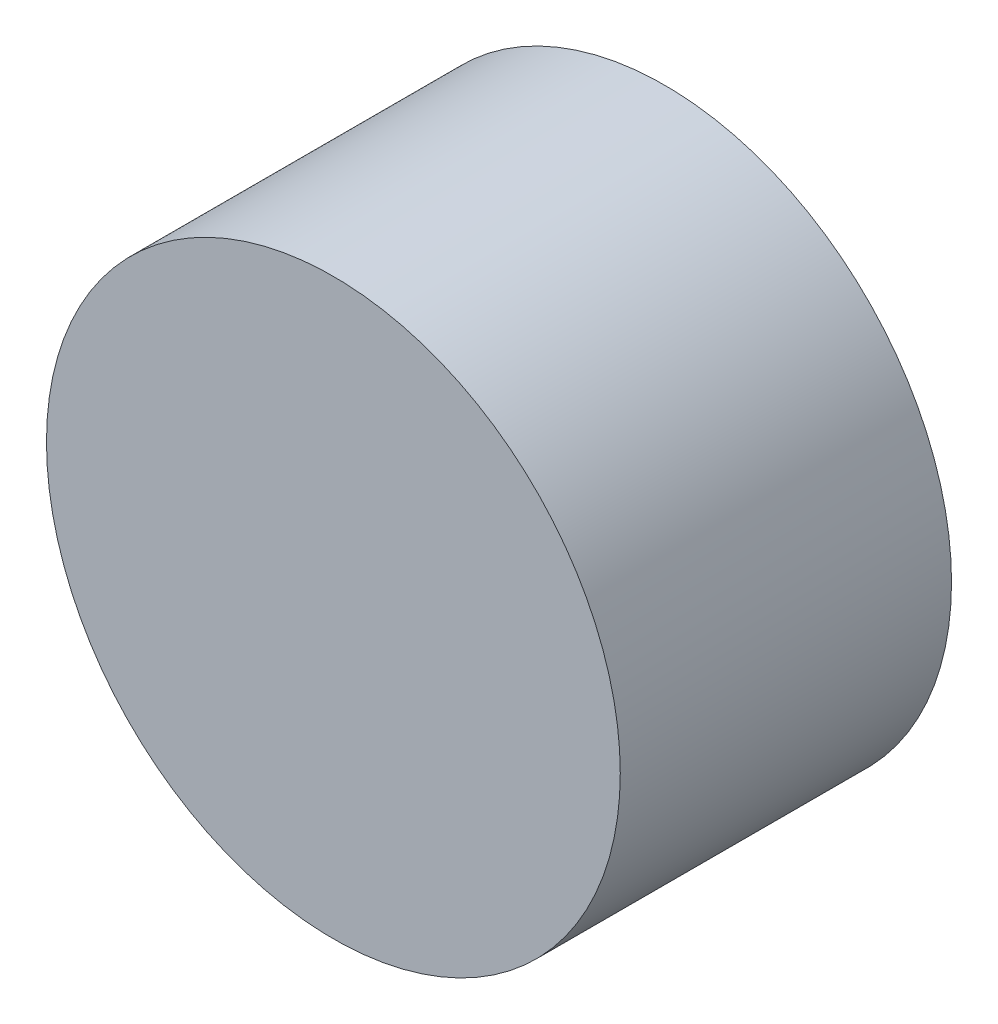
ISO-10303-21;
HEADER;
FILE_DESCRIPTION(('STEP AP214'),'2;1');
FILE_NAME('part.step','',(''),(''),'','','');
FILE_SCHEMA(('AUTOMOTIVE_DESIGN { 1 0 10303 214 1 1 1 1 }'));
ENDSEC;
DATA;
#1=APPLICATION_CONTEXT('core data for automotive mechanical design processes');
#2=APPLICATION_PROTOCOL_DEFINITION('international standard','automotive_design',2000,#1);
#3=PRODUCT_CONTEXT('',#1,'mechanical');
#4=PRODUCT('Part','Part','',(#3));
#5=PRODUCT_RELATED_PRODUCT_CATEGORY('part','',(#4));
#6=PRODUCT_DEFINITION_FORMATION('','',#4);
#7=PRODUCT_DEFINITION_CONTEXT('part definition',#1,'design');
#8=PRODUCT_DEFINITION('design','',#6,#7);
#9=PRODUCT_DEFINITION_SHAPE('','',#8);
#10=(LENGTH_UNIT() NAMED_UNIT(*) SI_UNIT(.MILLI.,.METRE.));
#11=(NAMED_UNIT(*) PLANE_ANGLE_UNIT() SI_UNIT($,.RADIAN.));
#12=(NAMED_UNIT(*) SI_UNIT($,.STERADIAN.) SOLID_ANGLE_UNIT());
#13=UNCERTAINTY_MEASURE_WITH_UNIT(LENGTH_MEASURE(1.E-05),#10,'distance_accuracy_value','');
#14=(GEOMETRIC_REPRESENTATION_CONTEXT(3) GLOBAL_UNCERTAINTY_ASSIGNED_CONTEXT((#13)) GLOBAL_UNIT_ASSIGNED_CONTEXT((#10,
#11,#12)) REPRESENTATION_CONTEXT('',''));
#15=CARTESIAN_POINT('',(0.,0.,0.));
#16=DIRECTION('',(0.,0.,1.));
#17=DIRECTION('',(1.,0.,0.));
#18=AXIS2_PLACEMENT_3D('',#15,#16,#17);
#19=CARTESIAN_POINT('',(0.,0.,6.35));
#20=DIRECTION('',(0.,0.,-1.));
#21=DIRECTION('',(-1.,0.,0.));
#22=AXIS2_PLACEMENT_3D('',#19,#20,#21);
#23=CYLINDRICAL_SURFACE('',#22,5.5);
#24=CARTESIAN_POINT('',(0.,0.,0.));
#25=DIRECTION('',(0.,0.,1.));
#26=DIRECTION('',(1.,0.,0.));
#27=AXIS2_PLACEMENT_3D('',#24,#25,#26);
#28=CIRCLE('',#27,5.5);
#29=CARTESIAN_POINT('',(5.5,0.,0.));
#30=VERTEX_POINT('',#29);
#31=EDGE_CURVE('E34',#30,#30,#28,.T.);
#32=ORIENTED_EDGE('',*,*,#31,.T.);
#33=EDGE_LOOP('',(#32));
#34=FACE_BOUND('',#33,.T.);
#35=CARTESIAN_POINT('',(0.,0.,6.35));
#36=DIRECTION('',(0.,0.,1.));
#37=DIRECTION('',(-1.,0.,0.));
#38=AXIS2_PLACEMENT_3D('',#35,#36,#37);
#39=CIRCLE('',#38,5.5);
#40=CARTESIAN_POINT('',(-5.5,0.,6.35));
#41=VERTEX_POINT('',#40);
#42=EDGE_CURVE('E10',#41,#41,#39,.T.);
#43=ORIENTED_EDGE('',*,*,#42,.F.);
#44=EDGE_LOOP('',(#43));
#45=FACE_BOUND('',#44,.T.);
#46=ADVANCED_FACE('F31',(#34,#45),#23,.T.);
#47=CARTESIAN_POINT('',(0.,0.,6.35));
#48=DIRECTION('',(0.,0.,-1.));
#49=DIRECTION('',(-1.,0.,0.));
#50=AXIS2_PLACEMENT_3D('',#47,#48,#49);
#51=PLANE('',#50);
#52=ORIENTED_EDGE('',*,*,#42,.T.);
#53=EDGE_LOOP('',(#52));
#54=FACE_BOUND('',#53,.T.);
#55=ADVANCED_FACE('F47',(#54),#51,.F.);
#56=CARTESIAN_POINT('',(0.,0.,0.));
#57=DIRECTION('',(0.,0.,-1.));
#58=DIRECTION('',(-1.,0.,0.));
#59=AXIS2_PLACEMENT_3D('',#56,#57,#58);
#60=PLANE('',#59);
#61=ORIENTED_EDGE('',*,*,#31,.F.);
#62=EDGE_LOOP('',(#61));
#63=FACE_BOUND('',#62,.T.);
#64=ADVANCED_FACE('F45',(#63),#60,.T.);
#65=CLOSED_SHELL('',(#46,#55,#64));
#66=MANIFOLD_SOLID_BREP('B2',#65);
#67=ADVANCED_BREP_SHAPE_REPRESENTATION('',(#18,#66),#14);
#68=SHAPE_DEFINITION_REPRESENTATION(#9,#67);
ENDSEC;
END-ISO-10303-21;
